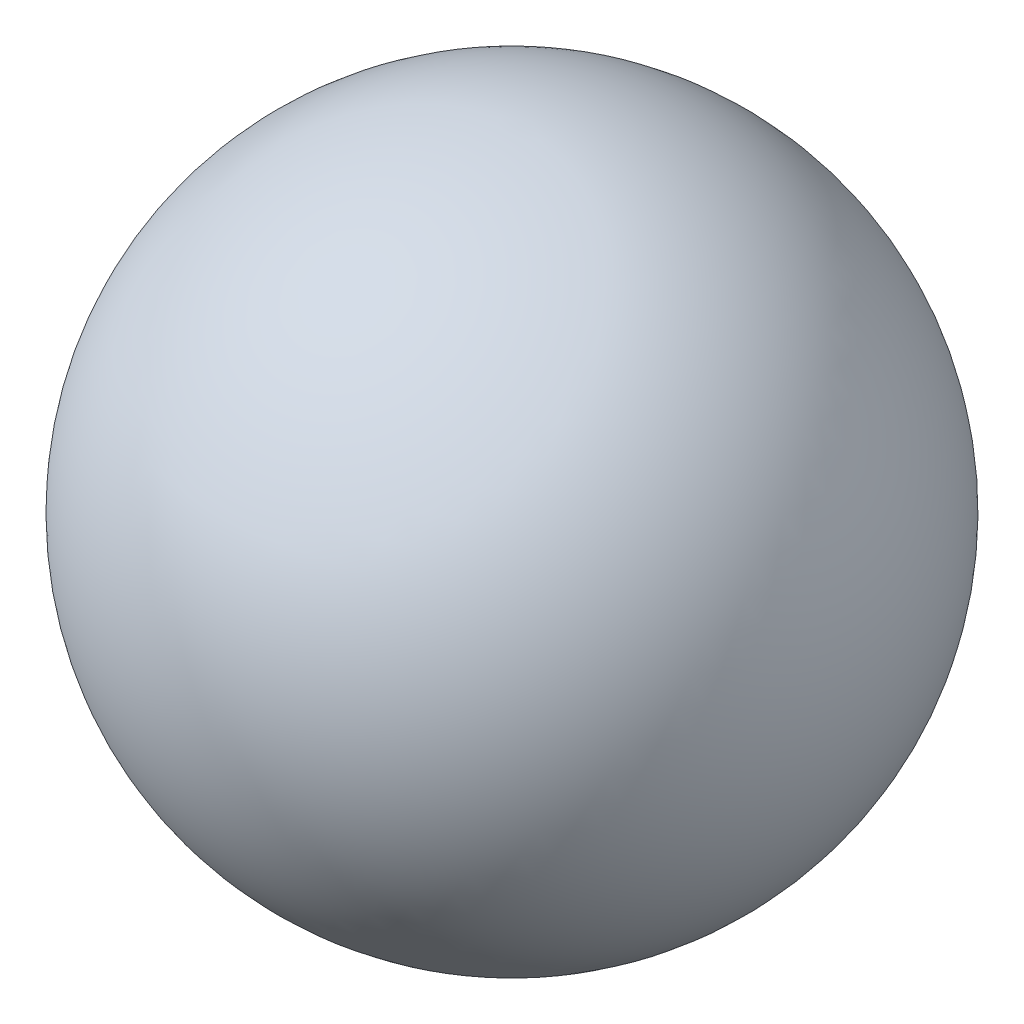
ISO-10303-21;
HEADER;
FILE_DESCRIPTION(('STEP AP214'),'2;1');
FILE_NAME('part.step','',(''),(''),'','','');
FILE_SCHEMA(('AUTOMOTIVE_DESIGN { 1 0 10303 214 1 1 1 1 }'));
ENDSEC;
DATA;
#1=APPLICATION_CONTEXT('core data for automotive mechanical design processes');
#2=APPLICATION_PROTOCOL_DEFINITION('international standard','automotive_design',2000,#1);
#3=PRODUCT_CONTEXT('',#1,'mechanical');
#4=PRODUCT('Part','Part','',(#3));
#5=PRODUCT_RELATED_PRODUCT_CATEGORY('part','',(#4));
#6=PRODUCT_DEFINITION_FORMATION('','',#4);
#7=PRODUCT_DEFINITION_CONTEXT('part definition',#1,'design');
#8=PRODUCT_DEFINITION('design','',#6,#7);
#9=PRODUCT_DEFINITION_SHAPE('','',#8);
#10=(LENGTH_UNIT() NAMED_UNIT(*) SI_UNIT(.MILLI.,.METRE.));
#11=(NAMED_UNIT(*) PLANE_ANGLE_UNIT() SI_UNIT($,.RADIAN.));
#12=(NAMED_UNIT(*) SI_UNIT($,.STERADIAN.) SOLID_ANGLE_UNIT());
#13=UNCERTAINTY_MEASURE_WITH_UNIT(LENGTH_MEASURE(1.E-05),#10,'distance_accuracy_value','');
#14=(GEOMETRIC_REPRESENTATION_CONTEXT(3) GLOBAL_UNCERTAINTY_ASSIGNED_CONTEXT((#13)) GLOBAL_UNIT_ASSIGNED_CONTEXT((#10,
#11,#12)) REPRESENTATION_CONTEXT('',''));
#15=CARTESIAN_POINT('',(0.,0.,0.));
#16=DIRECTION('',(0.,0.,1.));
#17=DIRECTION('',(1.,0.,0.));
#18=AXIS2_PLACEMENT_3D('',#15,#16,#17);
#19=CARTESIAN_POINT('',(64.16,-69.2599354328162,4.13062136271612));
#20=DIRECTION('',(0.,-0.998226300863564,0.0595336229727179));
#21=DIRECTION('',(0.173648177666934,-0.0586291734684379,-0.983061000351128));
#22=AXIS2_PLACEMENT_3D('',#19,#20,#21);
#23=SPHERICAL_SURFACE('',#22,7.15);
#24=CARTESIAN_POINT('',(64.16,-62.1226173816418,3.70495595846119));
#25=VERTEX_POINT('',#24);
#26=VERTEX_LOOP('',#25);
#27=FACE_BOUND('',#26,.T.);
#28=CARTESIAN_POINT('',(64.16,-76.3972534839906,4.55628676697106));
#29=VERTEX_POINT('',#28);
#30=VERTEX_LOOP('',#29);
#31=FACE_BOUND('',#30,.T.);
#32=ADVANCED_FACE('F15',(#27,#31),#23,.T.);
#33=CLOSED_SHELL('',(#32));
#34=MANIFOLD_SOLID_BREP('B1',#33);
#35=ADVANCED_BREP_SHAPE_REPRESENTATION('',(#18,#34),#14);
#36=SHAPE_DEFINITION_REPRESENTATION(#9,#35);
ENDSEC;
END-ISO-10303-21;
